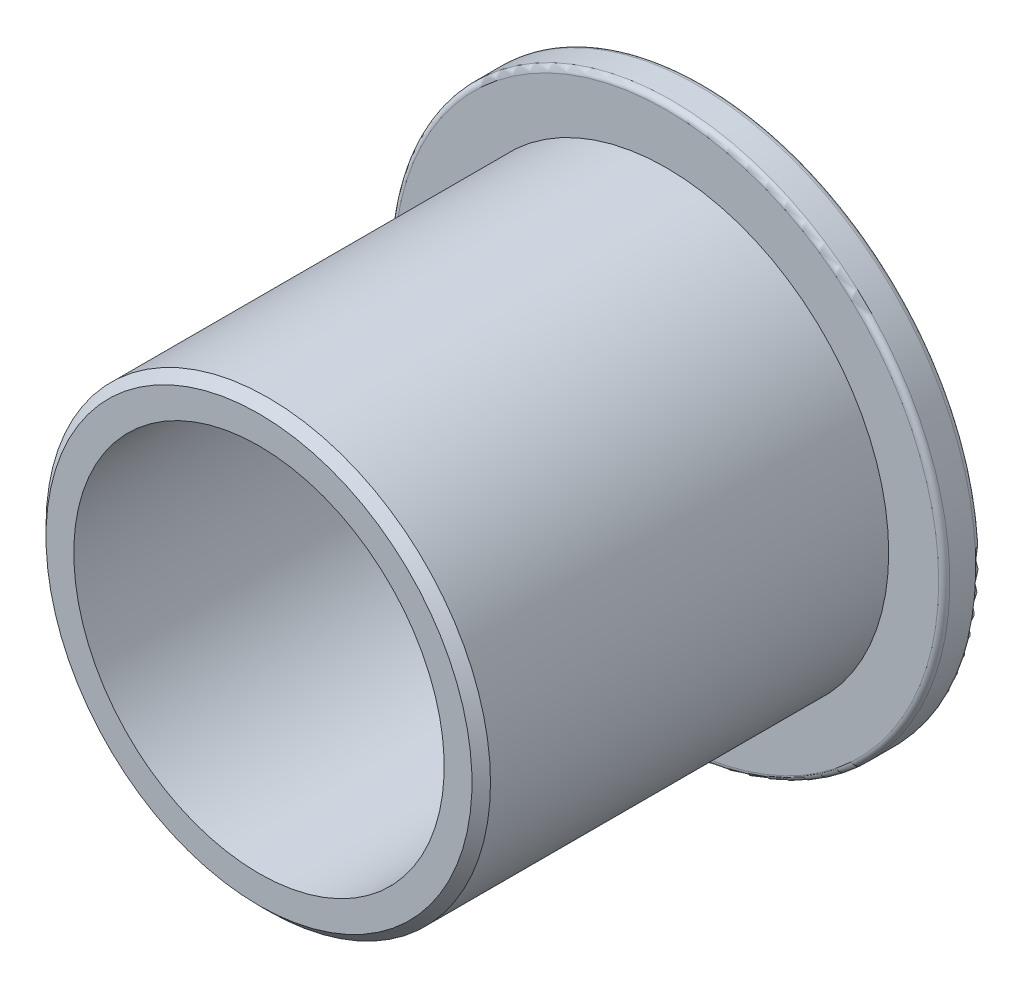
ISO-10303-21;
HEADER;
FILE_DESCRIPTION(('STEP AP214'),'2;1');
FILE_NAME('part.step','',(''),(''),'','','');
FILE_SCHEMA(('AUTOMOTIVE_DESIGN { 1 0 10303 214 1 1 1 1 }'));
ENDSEC;
DATA;
#1=APPLICATION_CONTEXT('core data for automotive mechanical design processes');
#2=APPLICATION_PROTOCOL_DEFINITION('international standard','automotive_design',2000,#1);
#3=PRODUCT_CONTEXT('',#1,'mechanical');
#4=PRODUCT('Part','Part','',(#3));
#5=PRODUCT_RELATED_PRODUCT_CATEGORY('part','',(#4));
#6=PRODUCT_DEFINITION_FORMATION('','',#4);
#7=PRODUCT_DEFINITION_CONTEXT('part definition',#1,'design');
#8=PRODUCT_DEFINITION('design','',#6,#7);
#9=PRODUCT_DEFINITION_SHAPE('','',#8);
#10=(LENGTH_UNIT() NAMED_UNIT(*) SI_UNIT(.MILLI.,.METRE.));
#11=(NAMED_UNIT(*) PLANE_ANGLE_UNIT() SI_UNIT($,.RADIAN.));
#12=(NAMED_UNIT(*) SI_UNIT($,.STERADIAN.) SOLID_ANGLE_UNIT());
#13=UNCERTAINTY_MEASURE_WITH_UNIT(LENGTH_MEASURE(1.E-05),#10,'distance_accuracy_value','');
#14=(GEOMETRIC_REPRESENTATION_CONTEXT(3) GLOBAL_UNCERTAINTY_ASSIGNED_CONTEXT((#13)) GLOBAL_UNIT_ASSIGNED_CONTEXT((#10,
#11,#12)) REPRESENTATION_CONTEXT('',''));
#15=CARTESIAN_POINT('',(0.,0.,0.));
#16=DIRECTION('',(0.,0.,1.));
#17=DIRECTION('',(1.,0.,0.));
#18=AXIS2_PLACEMENT_3D('',#15,#16,#17);
#19=CARTESIAN_POINT('',(0.,9.525,9.52500000000001));
#20=DIRECTION('',(0.,0.,-1.));
#21=DIRECTION('',(0.,1.,0.));
#22=AXIS2_PLACEMENT_3D('',#19,#20,#21);
#23=PLANE('',#22);
#24=CARTESIAN_POINT('',(0.,0.,9.525));
#25=DIRECTION('',(0.,0.,-1.));
#26=DIRECTION('',(0.,1.,0.));
#27=AXIS2_PLACEMENT_3D('',#24,#25,#26);
#28=CIRCLE('',#27,9.128125);
#29=CARTESIAN_POINT('',(0.,9.128125,9.52500000000001));
#30=VERTEX_POINT('',#29);
#31=EDGE_CURVE('E70',#30,#30,#28,.F.);
#32=ORIENTED_EDGE('',*,*,#31,.T.);
#33=EDGE_LOOP('',(#32));
#34=FACE_BOUND('',#33,.T.);
#35=CARTESIAN_POINT('',(0.,0.,9.525));
#36=DIRECTION('',(0.,0.,1.));
#37=DIRECTION('',(0.,-1.,0.));
#38=AXIS2_PLACEMENT_3D('',#35,#36,#37);
#39=CIRCLE('',#38,7.9375);
#40=CARTESIAN_POINT('',(0.,-7.9375,9.525));
#41=VERTEX_POINT('',#40);
#42=EDGE_CURVE('E73',#41,#41,#39,.T.);
#43=ORIENTED_EDGE('',*,*,#42,.F.);
#44=EDGE_LOOP('',(#43));
#45=FACE_BOUND('',#44,.T.);
#46=ADVANCED_FACE('F41',(#34,#45),#23,.F.);
#47=CARTESIAN_POINT('',(0.,0.,9.525));
#48=DIRECTION('',(0.,0.,1.));
#49=DIRECTION('',(0.,-1.,0.));
#50=AXIS2_PLACEMENT_3D('',#47,#48,#49);
#51=CYLINDRICAL_SURFACE('',#50,7.9375);
#52=CARTESIAN_POINT('',(0.,0.,-8.73125));
#53=DIRECTION('',(0.,0.,1.));
#54=DIRECTION('',(0.,-1.,0.));
#55=AXIS2_PLACEMENT_3D('',#52,#53,#54);
#56=CIRCLE('',#55,7.9375);
#57=CARTESIAN_POINT('',(0.,-7.93749999999999,-8.73125));
#58=VERTEX_POINT('',#57);
#59=EDGE_CURVE('E10',#58,#58,#56,.F.);
#60=ORIENTED_EDGE('',*,*,#59,.T.);
#61=EDGE_LOOP('',(#60));
#62=FACE_BOUND('',#61,.T.);
#63=ORIENTED_EDGE('',*,*,#42,.T.);
#64=EDGE_LOOP('',(#63));
#65=FACE_BOUND('',#64,.T.);
#66=ADVANCED_FACE('F99',(#62,#65),#51,.F.);
#67=CARTESIAN_POINT('',(0.,7.9375,-9.525));
#68=DIRECTION('',(0.,0.,1.));
#69=DIRECTION('',(0.,-1.,0.));
#70=AXIS2_PLACEMENT_3D('',#67,#68,#69);
#71=PLANE('',#70);
#72=CARTESIAN_POINT('',(0.,0.,-9.525));
#73=DIRECTION('',(0.,0.,1.));
#74=DIRECTION('',(0.,-1.,0.));
#75=AXIS2_PLACEMENT_3D('',#72,#73,#74);
#76=CIRCLE('',#75,8.73124999999999);
#77=CARTESIAN_POINT('',(0.,-8.73124999999999,-9.525));
#78=VERTEX_POINT('',#77);
#79=EDGE_CURVE('E48',#78,#78,#76,.T.);
#80=ORIENTED_EDGE('',*,*,#79,.T.);
#81=EDGE_LOOP('',(#80));
#82=FACE_BOUND('',#81,.T.);
#83=CARTESIAN_POINT('',(0.,0.,-9.525));
#84=DIRECTION('',(0.,0.,1.));
#85=DIRECTION('',(0.,-1.,0.));
#86=AXIS2_PLACEMENT_3D('',#83,#84,#85);
#87=CIRCLE('',#86,11.668125);
#88=CARTESIAN_POINT('',(0.,-11.668125,-9.525));
#89=VERTEX_POINT('',#88);
#90=EDGE_CURVE('E56',#89,#89,#87,.F.);
#91=ORIENTED_EDGE('',*,*,#90,.T.);
#92=EDGE_LOOP('',(#91));
#93=FACE_BOUND('',#92,.T.);
#94=ADVANCED_FACE('F95',(#82,#93),#71,.F.);
#95=CARTESIAN_POINT('',(0.,0.,9.525));
#96=DIRECTION('',(0.,0.,1.));
#97=DIRECTION('',(0.,-1.,0.));
#98=AXIS2_PLACEMENT_3D('',#95,#96,#97);
#99=CYLINDRICAL_SURFACE('',#98,11.90625);
#100=CARTESIAN_POINT('',(0.,0.,-9.28687499999999));
#101=DIRECTION('',(0.,0.,1.));
#102=DIRECTION('',(0.,-1.,0.));
#103=AXIS2_PLACEMENT_3D('',#100,#101,#102);
#104=CIRCLE('',#103,11.90625);
#105=CARTESIAN_POINT('',(0.,-11.90625,-9.286875));
#106=VERTEX_POINT('',#105);
#107=EDGE_CURVE('E61',#106,#106,#104,.T.);
#108=ORIENTED_EDGE('',*,*,#107,.T.);
#109=EDGE_LOOP('',(#108));
#110=FACE_BOUND('',#109,.T.);
#111=CARTESIAN_POINT('',(0.,0.,-8.17562499999999));
#112=DIRECTION('',(0.,0.,-1.));
#113=DIRECTION('',(0.,1.,0.));
#114=AXIS2_PLACEMENT_3D('',#111,#112,#113);
#115=CIRCLE('',#114,11.90625);
#116=CARTESIAN_POINT('',(0.,11.90625,-8.17562499999999));
#117=VERTEX_POINT('',#116);
#118=EDGE_CURVE('E64',#117,#117,#115,.T.);
#119=ORIENTED_EDGE('',*,*,#118,.T.);
#120=EDGE_LOOP('',(#119));
#121=FACE_BOUND('',#120,.T.);
#122=ADVANCED_FACE('F84',(#110,#121),#99,.T.);
#123=CARTESIAN_POINT('',(0.,11.90625,-7.93749999999999));
#124=DIRECTION('',(0.,0.,-1.));
#125=DIRECTION('',(0.,1.,0.));
#126=AXIS2_PLACEMENT_3D('',#123,#124,#125);
#127=PLANE('',#126);
#128=CARTESIAN_POINT('',(0.,0.,-7.93749999999999));
#129=DIRECTION('',(0.,0.,-1.));
#130=DIRECTION('',(0.,1.,0.));
#131=AXIS2_PLACEMENT_3D('',#128,#129,#130);
#132=CIRCLE('',#131,11.668125);
#133=CARTESIAN_POINT('',(0.,11.668125,-7.93749999999999));
#134=VERTEX_POINT('',#133);
#135=EDGE_CURVE('E52',#134,#134,#132,.F.);
#136=ORIENTED_EDGE('',*,*,#135,.T.);
#137=EDGE_LOOP('',(#136));
#138=FACE_BOUND('',#137,.T.);
#139=CARTESIAN_POINT('',(0.,0.,-7.93749999999999));
#140=DIRECTION('',(0.,0.,1.));
#141=DIRECTION('',(0.,-1.,0.));
#142=AXIS2_PLACEMENT_3D('',#139,#140,#141);
#143=CIRCLE('',#142,9.525);
#144=CARTESIAN_POINT('',(0.,-9.525,-7.9375));
#145=VERTEX_POINT('',#144);
#146=EDGE_CURVE('E76',#145,#145,#143,.T.);
#147=ORIENTED_EDGE('',*,*,#146,.F.);
#148=EDGE_LOOP('',(#147));
#149=FACE_BOUND('',#148,.T.);
#150=ADVANCED_FACE('F82',(#138,#149),#127,.F.);
#151=CARTESIAN_POINT('',(0.,0.,9.525));
#152=DIRECTION('',(0.,0.,1.));
#153=DIRECTION('',(0.,-1.,0.));
#154=AXIS2_PLACEMENT_3D('',#151,#152,#153);
#155=CYLINDRICAL_SURFACE('',#154,9.525);
#156=CARTESIAN_POINT('',(0.,0.,9.12812500000001));
#157=DIRECTION('',(0.,0.,-1.));
#158=DIRECTION('',(0.,1.,0.));
#159=AXIS2_PLACEMENT_3D('',#156,#157,#158);
#160=CIRCLE('',#159,9.525);
#161=CARTESIAN_POINT('',(0.,9.525,9.12812500000001));
#162=VERTEX_POINT('',#161);
#163=EDGE_CURVE('E67',#162,#162,#160,.T.);
#164=ORIENTED_EDGE('',*,*,#163,.T.);
#165=EDGE_LOOP('',(#164));
#166=FACE_BOUND('',#165,.T.);
#167=ORIENTED_EDGE('',*,*,#146,.T.);
#168=EDGE_LOOP('',(#167));
#169=FACE_BOUND('',#168,.T.);
#170=ADVANCED_FACE('F80',(#166,#169),#155,.T.);
#171=CARTESIAN_POINT('',(0.,0.,9.525));
#172=DIRECTION('',(0.,0.,-1.));
#173=DIRECTION('',(0.,1.,0.));
#174=AXIS2_PLACEMENT_3D('',#171,#172,#173);
#175=CONICAL_SURFACE('',#174,9.128125,0.785398163397446);
#176=ORIENTED_EDGE('',*,*,#163,.F.);
#177=EDGE_LOOP('',(#176));
#178=FACE_BOUND('',#177,.T.);
#179=ORIENTED_EDGE('',*,*,#31,.F.);
#180=EDGE_LOOP('',(#179));
#181=FACE_BOUND('',#180,.T.);
#182=ADVANCED_FACE('F92',(#178,#181),#175,.T.);
#183=CARTESIAN_POINT('',(0.,0.,-9.28687499999999));
#184=DIRECTION('',(0.,0.,1.));
#185=DIRECTION('',(0.,-1.,0.));
#186=AXIS2_PLACEMENT_3D('',#183,#184,#185);
#187=TOROIDAL_SURFACE('',#186,11.668125,0.238125);
#188=ORIENTED_EDGE('',*,*,#90,.F.);
#189=EDGE_LOOP('',(#188));
#190=FACE_BOUND('',#189,.T.);
#191=ORIENTED_EDGE('',*,*,#107,.F.);
#192=EDGE_LOOP('',(#191));
#193=FACE_BOUND('',#192,.T.);
#194=ADVANCED_FACE('F111',(#190,#193),#187,.T.);
#195=CARTESIAN_POINT('',(0.,0.,-8.175625));
#196=DIRECTION('',(0.,0.,-1.));
#197=DIRECTION('',(0.,1.,0.));
#198=AXIS2_PLACEMENT_3D('',#195,#196,#197);
#199=TOROIDAL_SURFACE('',#198,11.668125,0.238125);
#200=ORIENTED_EDGE('',*,*,#118,.F.);
#201=EDGE_LOOP('',(#200));
#202=FACE_BOUND('',#201,.T.);
#203=ORIENTED_EDGE('',*,*,#135,.F.);
#204=EDGE_LOOP('',(#203));
#205=FACE_BOUND('',#204,.T.);
#206=ADVANCED_FACE('F113',(#202,#205),#199,.T.);
#207=CARTESIAN_POINT('',(0.,0.,-9.525));
#208=DIRECTION('',(0.,0.,-1.));
#209=DIRECTION('',(0.,1.,0.));
#210=AXIS2_PLACEMENT_3D('',#207,#208,#209);
#211=CONICAL_SURFACE('',#210,8.73124999999999,0.785398163397447);
#212=ORIENTED_EDGE('',*,*,#59,.F.);
#213=EDGE_LOOP('',(#212));
#214=FACE_BOUND('',#213,.T.);
#215=ORIENTED_EDGE('',*,*,#79,.F.);
#216=EDGE_LOOP('',(#215));
#217=FACE_BOUND('',#216,.T.);
#218=ADVANCED_FACE('F43',(#214,#217),#211,.F.);
#219=CLOSED_SHELL('',(#46,#66,#94,#122,#150,#170,#182,#194,#206,#218));
#220=MANIFOLD_SOLID_BREP('B2',#219);
#221=ADVANCED_BREP_SHAPE_REPRESENTATION('',(#18,#220),#14);
#222=SHAPE_DEFINITION_REPRESENTATION(#9,#221);
ENDSEC;
END-ISO-10303-21;
